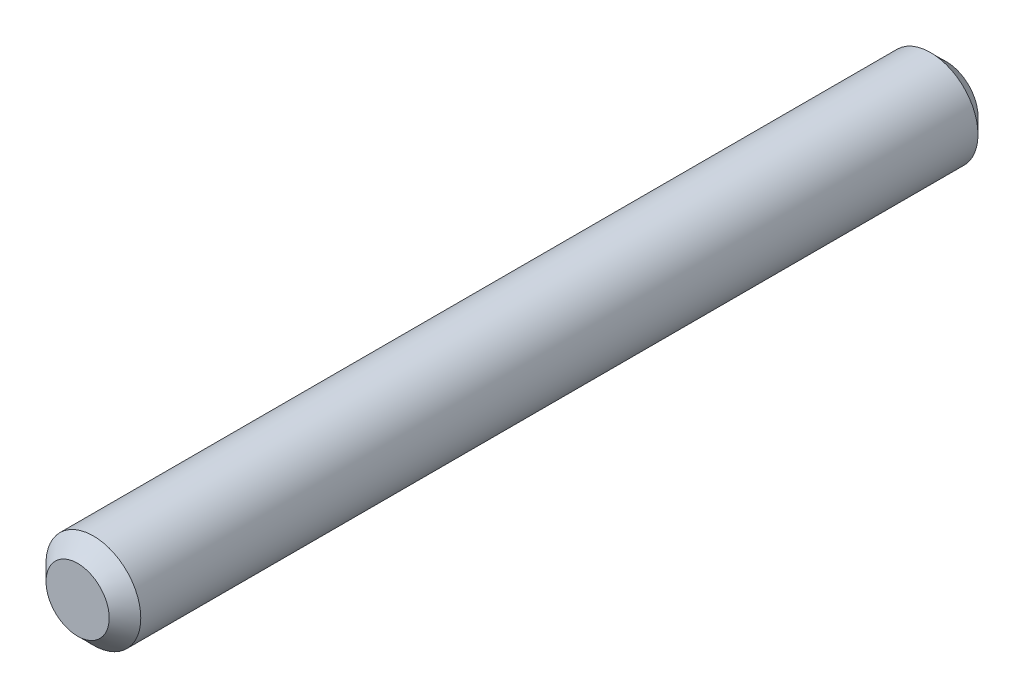
ISO-10303-21;
HEADER;
FILE_DESCRIPTION(('STEP AP214'),'2;1');
FILE_NAME('part.step','',(''),(''),'','','');
FILE_SCHEMA(('AUTOMOTIVE_DESIGN { 1 0 10303 214 1 1 1 1 }'));
ENDSEC;
DATA;
#1=APPLICATION_CONTEXT('core data for automotive mechanical design processes');
#2=APPLICATION_PROTOCOL_DEFINITION('international standard','automotive_design',2000,#1);
#3=PRODUCT_CONTEXT('',#1,'mechanical');
#4=PRODUCT('Part','Part','',(#3));
#5=PRODUCT_RELATED_PRODUCT_CATEGORY('part','',(#4));
#6=PRODUCT_DEFINITION_FORMATION('','',#4);
#7=PRODUCT_DEFINITION_CONTEXT('part definition',#1,'design');
#8=PRODUCT_DEFINITION('design','',#6,#7);
#9=PRODUCT_DEFINITION_SHAPE('','',#8);
#10=(LENGTH_UNIT() NAMED_UNIT(*) SI_UNIT(.MILLI.,.METRE.));
#11=(NAMED_UNIT(*) PLANE_ANGLE_UNIT() SI_UNIT($,.RADIAN.));
#12=(NAMED_UNIT(*) SI_UNIT($,.STERADIAN.) SOLID_ANGLE_UNIT());
#13=UNCERTAINTY_MEASURE_WITH_UNIT(LENGTH_MEASURE(1.E-05),#10,'distance_accuracy_value','');
#14=(GEOMETRIC_REPRESENTATION_CONTEXT(3) GLOBAL_UNCERTAINTY_ASSIGNED_CONTEXT((#13)) GLOBAL_UNIT_ASSIGNED_CONTEXT((#10,
#11,#12)) REPRESENTATION_CONTEXT('',''));
#15=CARTESIAN_POINT('',(0.,0.,0.));
#16=DIRECTION('',(0.,0.,1.));
#17=DIRECTION('',(1.,0.,0.));
#18=AXIS2_PLACEMENT_3D('',#15,#16,#17);
#19=CARTESIAN_POINT('',(0.,0.,55.));
#20=DIRECTION('',(0.,0.,-1.));
#21=DIRECTION('',(-1.,0.,0.));
#22=AXIS2_PLACEMENT_3D('',#19,#20,#21);
#23=CYLINDRICAL_SURFACE('',#22,3.);
#24=CARTESIAN_POINT('',(0.,0.,1.));
#25=DIRECTION('',(0.,0.,1.));
#26=DIRECTION('',(1.,0.,0.));
#27=AXIS2_PLACEMENT_3D('',#24,#25,#26);
#28=CIRCLE('',#27,3.);
#29=CARTESIAN_POINT('',(3.,0.,1.));
#30=VERTEX_POINT('',#29);
#31=EDGE_CURVE('E59',#30,#30,#28,.T.);
#32=ORIENTED_EDGE('',*,*,#31,.T.);
#33=EDGE_LOOP('',(#32));
#34=FACE_BOUND('',#33,.T.);
#35=CARTESIAN_POINT('',(0.,0.,54.));
#36=DIRECTION('',(0.,0.,1.));
#37=DIRECTION('',(1.,0.,0.));
#38=AXIS2_PLACEMENT_3D('',#35,#36,#37);
#39=CIRCLE('',#38,3.);
#40=CARTESIAN_POINT('',(3.,0.,54.));
#41=VERTEX_POINT('',#40);
#42=EDGE_CURVE('E64',#41,#41,#39,.F.);
#43=ORIENTED_EDGE('',*,*,#42,.T.);
#44=EDGE_LOOP('',(#43));
#45=FACE_BOUND('',#44,.T.);
#46=ADVANCED_FACE('F45',(#34,#45),#23,.T.);
#47=CARTESIAN_POINT('',(0.,0.,55.));
#48=DIRECTION('',(0.,0.,1.));
#49=DIRECTION('',(1.,0.,0.));
#50=AXIS2_PLACEMENT_3D('',#47,#48,#49);
#51=PLANE('',#50);
#52=CARTESIAN_POINT('',(0.,0.,55.));
#53=DIRECTION('',(0.,0.,1.));
#54=DIRECTION('',(1.,0.,0.));
#55=AXIS2_PLACEMENT_3D('',#52,#53,#54);
#56=CIRCLE('',#55,1.99999999999999);
#57=CARTESIAN_POINT('',(1.99999999999999,0.,55.));
#58=VERTEX_POINT('',#57);
#59=EDGE_CURVE('E10',#58,#58,#56,.T.);
#60=ORIENTED_EDGE('',*,*,#59,.T.);
#61=EDGE_LOOP('',(#60));
#62=FACE_BOUND('',#61,.T.);
#63=ADVANCED_FACE('F81',(#62),#51,.T.);
#64=CARTESIAN_POINT('',(0.,0.,0.));
#65=DIRECTION('',(0.,0.,1.));
#66=DIRECTION('',(1.,0.,0.));
#67=AXIS2_PLACEMENT_3D('',#64,#65,#66);
#68=PLANE('',#67);
#69=CARTESIAN_POINT('',(0.,0.,0.));
#70=DIRECTION('',(0.,0.,1.));
#71=DIRECTION('',(1.,0.,0.));
#72=AXIS2_PLACEMENT_3D('',#69,#70,#71);
#73=CIRCLE('',#72,2.);
#74=CARTESIAN_POINT('',(2.,0.,0.));
#75=VERTEX_POINT('',#74);
#76=EDGE_CURVE('E54',#75,#75,#73,.F.);
#77=ORIENTED_EDGE('',*,*,#76,.T.);
#78=EDGE_LOOP('',(#77));
#79=FACE_BOUND('',#78,.T.);
#80=ADVANCED_FACE('F78',(#79),#68,.F.);
#81=CARTESIAN_POINT('',(0.,0.,1.));
#82=DIRECTION('',(0.,0.,1.));
#83=DIRECTION('',(1.,0.,0.));
#84=AXIS2_PLACEMENT_3D('',#81,#82,#83);
#85=CONICAL_SURFACE('',#84,3.,0.78539816339745);
#86=ORIENTED_EDGE('',*,*,#76,.F.);
#87=EDGE_LOOP('',(#86));
#88=FACE_BOUND('',#87,.T.);
#89=ORIENTED_EDGE('',*,*,#31,.F.);
#90=EDGE_LOOP('',(#89));
#91=FACE_BOUND('',#90,.T.);
#92=ADVANCED_FACE('F74',(#88,#91),#85,.T.);
#93=CARTESIAN_POINT('',(0.,0.,55.));
#94=DIRECTION('',(0.,0.,-1.));
#95=DIRECTION('',(-1.,0.,0.));
#96=AXIS2_PLACEMENT_3D('',#93,#94,#95);
#97=CONICAL_SURFACE('',#96,1.99999999999999,0.785398163397447);
#98=ORIENTED_EDGE('',*,*,#42,.F.);
#99=EDGE_LOOP('',(#98));
#100=FACE_BOUND('',#99,.T.);
#101=ORIENTED_EDGE('',*,*,#59,.F.);
#102=EDGE_LOOP('',(#101));
#103=FACE_BOUND('',#102,.T.);
#104=ADVANCED_FACE('F48',(#100,#103),#97,.T.);
#105=CLOSED_SHELL('',(#46,#63,#80,#92,#104));
#106=MANIFOLD_SOLID_BREP('B2',#105);
#107=ADVANCED_BREP_SHAPE_REPRESENTATION('',(#18,#106),#14);
#108=SHAPE_DEFINITION_REPRESENTATION(#9,#107);
ENDSEC;
END-ISO-10303-21;
